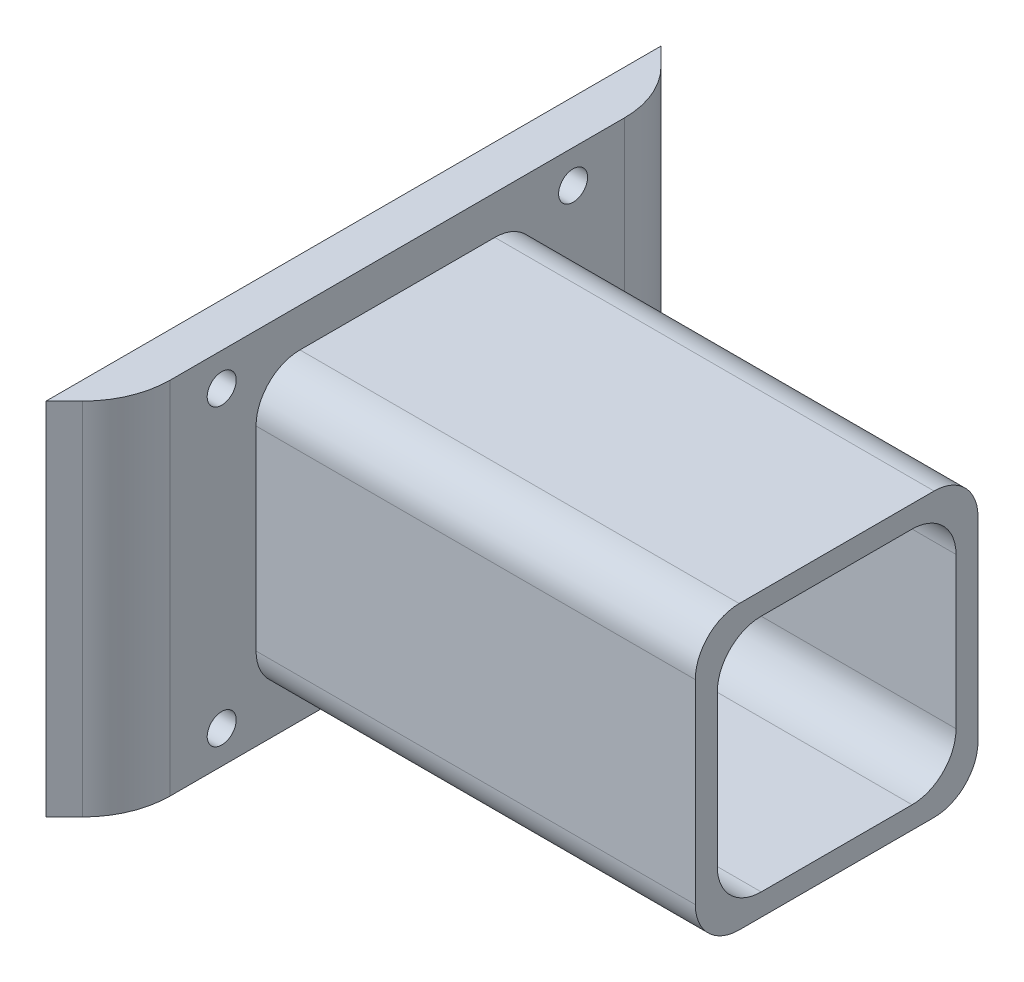
ISO-10303-21;
HEADER;
FILE_DESCRIPTION(('STEP AP214'),'2;1');
FILE_NAME('part.step','',(''),(''),'','','');
FILE_SCHEMA(('AUTOMOTIVE_DESIGN { 1 0 10303 214 1 1 1 1 }'));
ENDSEC;
DATA;
#1=APPLICATION_CONTEXT('core data for automotive mechanical design processes');
#2=APPLICATION_PROTOCOL_DEFINITION('international standard','automotive_design',2000,#1);
#3=PRODUCT_CONTEXT('',#1,'mechanical');
#4=PRODUCT('Part','Part','',(#3));
#5=PRODUCT_RELATED_PRODUCT_CATEGORY('part','',(#4));
#6=PRODUCT_DEFINITION_FORMATION('','',#4);
#7=PRODUCT_DEFINITION_CONTEXT('part definition',#1,'design');
#8=PRODUCT_DEFINITION('design','',#6,#7);
#9=PRODUCT_DEFINITION_SHAPE('','',#8);
#10=(LENGTH_UNIT() NAMED_UNIT(*) SI_UNIT(.MILLI.,.METRE.));
#11=(NAMED_UNIT(*) PLANE_ANGLE_UNIT() SI_UNIT($,.RADIAN.));
#12=(NAMED_UNIT(*) SI_UNIT($,.STERADIAN.) SOLID_ANGLE_UNIT());
#13=UNCERTAINTY_MEASURE_WITH_UNIT(LENGTH_MEASURE(1.E-05),#10,'distance_accuracy_value','');
#14=(GEOMETRIC_REPRESENTATION_CONTEXT(3) GLOBAL_UNCERTAINTY_ASSIGNED_CONTEXT((#13)) GLOBAL_UNIT_ASSIGNED_CONTEXT((#10,
#11,#12)) REPRESENTATION_CONTEXT('',''));
#15=CARTESIAN_POINT('',(0.,0.,0.));
#16=DIRECTION('',(0.,0.,1.));
#17=DIRECTION('',(1.,0.,0.));
#18=AXIS2_PLACEMENT_3D('',#15,#16,#17);
#19=CARTESIAN_POINT('',(10.,0.,0.));
#20=DIRECTION('',(-1.,0.,0.));
#21=DIRECTION('',(0.,0.,1.));
#22=AXIS2_PLACEMENT_3D('',#19,#20,#21);
#23=PLANE('',#22);
#24=DIRECTION('',(0.,0.,-1.));
#25=VECTOR('',#24,1.);
#26=CARTESIAN_POINT('',(10.,-41.,60.));
#27=LINE('',#26,#25);
#28=CARTESIAN_POINT('',(10.,-41.,51.7157287525381));
#29=VERTEX_POINT('',#28);
#30=CARTESIAN_POINT('',(10.,-41.,-51.7157287525381));
#31=VERTEX_POINT('',#30);
#32=EDGE_CURVE('E335',#29,#31,#27,.T.);
#33=ORIENTED_EDGE('',*,*,#32,.T.);
#34=DIRECTION('',(0.,1.,0.));
#35=VECTOR('',#34,1.);
#36=CARTESIAN_POINT('',(10.,41.,-51.7157287525381));
#37=LINE('',#36,#35);
#38=CARTESIAN_POINT('',(10.,41.,-51.7157287525381));
#39=VERTEX_POINT('',#38);
#40=EDGE_CURVE('E344',#31,#39,#37,.T.);
#41=ORIENTED_EDGE('',*,*,#40,.T.);
#42=DIRECTION('',(0.,0.,1.));
#43=VECTOR('',#42,1.);
#44=CARTESIAN_POINT('',(10.,41.,60.));
#45=LINE('',#44,#43);
#46=CARTESIAN_POINT('',(10.,41.,51.7157287525381));
#47=VERTEX_POINT('',#46);
#48=EDGE_CURVE('E332',#39,#47,#45,.T.);
#49=ORIENTED_EDGE('',*,*,#48,.T.);
#50=DIRECTION('',(0.,-1.,0.));
#51=VECTOR('',#50,1.);
#52=CARTESIAN_POINT('',(10.,-41.,51.7157287525381));
#53=LINE('',#52,#51);
#54=EDGE_CURVE('E339',#47,#29,#53,.T.);
#55=ORIENTED_EDGE('',*,*,#54,.T.);
#56=EDGE_LOOP('',(#33,#41,#49,#55));
#57=FACE_BOUND('',#56,.T.);
#58=CARTESIAN_POINT('',(10.,-22.18,-22.18));
#59=DIRECTION('',(1.,0.,0.));
#60=DIRECTION('',(0.,0.,-1.));
#61=AXIS2_PLACEMENT_3D('',#58,#59,#60);
#62=CIRCLE('',#61,10.);
#63=CARTESIAN_POINT('',(10.,-32.18,-22.1799999999999));
#64=VERTEX_POINT('',#63);
#65=CARTESIAN_POINT('',(10.,-22.1799999999999,-32.18));
#66=VERTEX_POINT('',#65);
#67=EDGE_CURVE('E201',#64,#66,#62,.T.);
#68=ORIENTED_EDGE('',*,*,#67,.F.);
#69=DIRECTION('',(0.,0.,-1.));
#70=VECTOR('',#69,1.);
#71=CARTESIAN_POINT('',(10.,-32.18,22.1799999999999));
#72=LINE('',#71,#70);
#73=CARTESIAN_POINT('',(10.,-32.18,22.1799999999999));
#74=VERTEX_POINT('',#73);
#75=EDGE_CURVE('E260',#74,#64,#72,.T.);
#76=ORIENTED_EDGE('',*,*,#75,.F.);
#77=CARTESIAN_POINT('',(10.,-22.18,22.18));
#78=DIRECTION('',(1.,0.,0.));
#79=DIRECTION('',(0.,0.,1.));
#80=AXIS2_PLACEMENT_3D('',#77,#78,#79);
#81=CIRCLE('',#80,10.);
#82=CARTESIAN_POINT('',(9.99999999999999,-22.18,32.18));
#83=VERTEX_POINT('',#82);
#84=EDGE_CURVE('E288',#83,#74,#81,.T.);
#85=ORIENTED_EDGE('',*,*,#84,.F.);
#86=DIRECTION('',(0.,-1.,0.));
#87=VECTOR('',#86,1.);
#88=CARTESIAN_POINT('',(10.,-22.1799999999999,32.18));
#89=LINE('',#88,#87);
#90=CARTESIAN_POINT('',(10.,22.1799999999999,32.18));
#91=VERTEX_POINT('',#90);
#92=EDGE_CURVE('E285',#91,#83,#89,.T.);
#93=ORIENTED_EDGE('',*,*,#92,.F.);
#94=CARTESIAN_POINT('',(10.,22.18,22.18));
#95=DIRECTION('',(1.,0.,0.));
#96=DIRECTION('',(0.,0.,1.));
#97=AXIS2_PLACEMENT_3D('',#94,#95,#96);
#98=CIRCLE('',#97,10.);
#99=CARTESIAN_POINT('',(9.99999999999999,32.18,22.1799999999999));
#100=VERTEX_POINT('',#99);
#101=EDGE_CURVE('E282',#100,#91,#98,.T.);
#102=ORIENTED_EDGE('',*,*,#101,.F.);
#103=DIRECTION('',(0.,0.,1.));
#104=VECTOR('',#103,1.);
#105=CARTESIAN_POINT('',(10.,32.18,22.1799999999999));
#106=LINE('',#105,#104);
#107=CARTESIAN_POINT('',(10.,32.18,-22.1799999999999));
#108=VERTEX_POINT('',#107);
#109=EDGE_CURVE('E279',#108,#100,#106,.T.);
#110=ORIENTED_EDGE('',*,*,#109,.F.);
#111=CARTESIAN_POINT('',(10.,22.18,-22.18));
#112=DIRECTION('',(1.,0.,0.));
#113=DIRECTION('',(0.,0.,1.));
#114=AXIS2_PLACEMENT_3D('',#111,#112,#113);
#115=CIRCLE('',#114,10.);
#116=CARTESIAN_POINT('',(9.99999999999999,22.1799999999999,-32.18));
#117=VERTEX_POINT('',#116);
#118=EDGE_CURVE('E56',#117,#108,#115,.T.);
#119=ORIENTED_EDGE('',*,*,#118,.F.);
#120=DIRECTION('',(0.,1.,0.));
#121=VECTOR('',#120,1.);
#122=CARTESIAN_POINT('',(10.,-22.1799999999999,-32.18));
#123=LINE('',#122,#121);
#124=EDGE_CURVE('E51',#66,#117,#123,.T.);
#125=ORIENTED_EDGE('',*,*,#124,.F.);
#126=EDGE_LOOP('',(#68,#76,#85,#93,#102,#110,#119,#125));
#127=FACE_BOUND('',#126,.T.);
#128=CARTESIAN_POINT('',(10.,-33.5,40.));
#129=DIRECTION('',(1.,0.,0.));
#130=DIRECTION('',(0.,0.,-1.));
#131=AXIS2_PLACEMENT_3D('',#128,#129,#130);
#132=CIRCLE('',#131,3.29999999999999);
#133=CARTESIAN_POINT('',(10.,-33.5,36.7));
#134=VERTEX_POINT('',#133);
#135=EDGE_CURVE('E502',#134,#134,#132,.T.);
#136=ORIENTED_EDGE('',*,*,#135,.F.);
#137=EDGE_LOOP('',(#136));
#138=FACE_BOUND('',#137,.T.);
#139=CARTESIAN_POINT('',(10.,-33.5,-40.));
#140=DIRECTION('',(1.,0.,0.));
#141=DIRECTION('',(0.,0.,-1.));
#142=AXIS2_PLACEMENT_3D('',#139,#140,#141);
#143=CIRCLE('',#142,3.29999999999999);
#144=CARTESIAN_POINT('',(10.,-33.5,-43.3));
#145=VERTEX_POINT('',#144);
#146=EDGE_CURVE('E506',#145,#145,#143,.T.);
#147=ORIENTED_EDGE('',*,*,#146,.F.);
#148=EDGE_LOOP('',(#147));
#149=FACE_BOUND('',#148,.T.);
#150=CARTESIAN_POINT('',(10.,33.5,-40.));
#151=DIRECTION('',(1.,0.,0.));
#152=DIRECTION('',(0.,0.,-1.));
#153=AXIS2_PLACEMENT_3D('',#150,#151,#152);
#154=CIRCLE('',#153,3.29999999999998);
#155=CARTESIAN_POINT('',(10.,33.5,-43.3));
#156=VERTEX_POINT('',#155);
#157=EDGE_CURVE('E510',#156,#156,#154,.T.);
#158=ORIENTED_EDGE('',*,*,#157,.F.);
#159=EDGE_LOOP('',(#158));
#160=FACE_BOUND('',#159,.T.);
#161=CARTESIAN_POINT('',(10.,33.5,40.));
#162=DIRECTION('',(1.,0.,0.));
#163=DIRECTION('',(0.,0.,-1.));
#164=AXIS2_PLACEMENT_3D('',#161,#162,#163);
#165=CIRCLE('',#164,3.29999999999998);
#166=CARTESIAN_POINT('',(10.,33.5,36.7));
#167=VERTEX_POINT('',#166);
#168=EDGE_CURVE('E513',#167,#167,#165,.T.);
#169=ORIENTED_EDGE('',*,*,#168,.F.);
#170=EDGE_LOOP('',(#169));
#171=FACE_BOUND('',#170,.T.);
#172=ADVANCED_FACE('F36',(#57,#127,#138,#149,#160,#171),#23,.F.);
#173=CARTESIAN_POINT('',(10.,41.,60.));
#174=DIRECTION('',(0.,-1.,0.));
#175=DIRECTION('',(0.,0.,-1.));
#176=AXIS2_PLACEMENT_3D('',#173,#174,#175);
#177=PLANE('',#176);
#178=ORIENTED_EDGE('',*,*,#48,.F.);
#179=CARTESIAN_POINT('',(-10.,41.,-51.7157287525381));
#180=DIRECTION('',(0.,-1.,0.));
#181=DIRECTION('',(0.,0.,-1.));
#182=AXIS2_PLACEMENT_3D('',#179,#180,#181);
#183=CIRCLE('',#182,20.);
#184=CARTESIAN_POINT('',(4.14213562373096,41.,-65.857864376269));
#185=VERTEX_POINT('',#184);
#186=EDGE_CURVE('E349',#39,#185,#183,.F.);
#187=ORIENTED_EDGE('',*,*,#186,.T.);
#188=DIRECTION('',(-0.707106781186547,0.,-0.707106781186548));
#189=VECTOR('',#188,1.);
#190=CARTESIAN_POINT('',(0.,41.,-70.));
#191=LINE('',#190,#189);
#192=CARTESIAN_POINT('',(0.,41.,-70.));
#193=VERTEX_POINT('',#192);
#194=EDGE_CURVE('E318',#185,#193,#191,.T.);
#195=ORIENTED_EDGE('',*,*,#194,.T.);
#196=DIRECTION('',(0.,0.,1.));
#197=VECTOR('',#196,1.);
#198=CARTESIAN_POINT('',(0.,41.,60.));
#199=LINE('',#198,#197);
#200=CARTESIAN_POINT('',(0.,41.,70.));
#201=VERTEX_POINT('',#200);
#202=EDGE_CURVE('E331',#193,#201,#199,.T.);
#203=ORIENTED_EDGE('',*,*,#202,.T.);
#204=DIRECTION('',(0.707106781186548,0.,-0.707106781186547));
#205=VECTOR('',#204,1.);
#206=CARTESIAN_POINT('',(0.,41.,70.));
#207=LINE('',#206,#205);
#208=CARTESIAN_POINT('',(4.14213562373093,41.,65.8578643762691));
#209=VERTEX_POINT('',#208);
#210=EDGE_CURVE('E315',#201,#209,#207,.T.);
#211=ORIENTED_EDGE('',*,*,#210,.T.);
#212=CARTESIAN_POINT('',(-10.,41.,51.7157287525381));
#213=DIRECTION('',(0.,-1.,0.));
#214=DIRECTION('',(0.,0.,-1.));
#215=AXIS2_PLACEMENT_3D('',#212,#213,#214);
#216=CIRCLE('',#215,20.);
#217=EDGE_CURVE('E347',#209,#47,#216,.F.);
#218=ORIENTED_EDGE('',*,*,#217,.T.);
#219=EDGE_LOOP('',(#178,#187,#195,#203,#211,#218));
#220=FACE_BOUND('',#219,.T.);
#221=ADVANCED_FACE('F368',(#220),#177,.F.);
#222=CARTESIAN_POINT('',(10.,-41.,60.));
#223=DIRECTION('',(0.,1.,0.));
#224=DIRECTION('',(0.,0.,1.));
#225=AXIS2_PLACEMENT_3D('',#222,#223,#224);
#226=PLANE('',#225);
#227=DIRECTION('',(0.707106781186547,0.,0.707106781186548));
#228=VECTOR('',#227,1.);
#229=CARTESIAN_POINT('',(0.,-41.,-70.));
#230=LINE('',#229,#228);
#231=CARTESIAN_POINT('',(0.,-41.,-70.));
#232=VERTEX_POINT('',#231);
#233=CARTESIAN_POINT('',(4.14213562373096,-41.,-65.857864376269));
#234=VERTEX_POINT('',#233);
#235=EDGE_CURVE('E328',#232,#234,#230,.T.);
#236=ORIENTED_EDGE('',*,*,#235,.T.);
#237=CARTESIAN_POINT('',(-10.,-41.,-51.7157287525381));
#238=DIRECTION('',(0.,1.,0.));
#239=DIRECTION('',(0.,0.,1.));
#240=AXIS2_PLACEMENT_3D('',#237,#238,#239);
#241=CIRCLE('',#240,20.);
#242=EDGE_CURVE('E44',#234,#31,#241,.F.);
#243=ORIENTED_EDGE('',*,*,#242,.T.);
#244=ORIENTED_EDGE('',*,*,#32,.F.);
#245=CARTESIAN_POINT('',(-10.,-41.,51.7157287525381));
#246=DIRECTION('',(0.,1.,0.));
#247=DIRECTION('',(0.,0.,1.));
#248=AXIS2_PLACEMENT_3D('',#245,#246,#247);
#249=CIRCLE('',#248,20.);
#250=CARTESIAN_POINT('',(4.14213562373093,-41.,65.8578643762691));
#251=VERTEX_POINT('',#250);
#252=EDGE_CURVE('E353',#29,#251,#249,.F.);
#253=ORIENTED_EDGE('',*,*,#252,.T.);
#254=DIRECTION('',(-0.707106781186548,0.,0.707106781186547));
#255=VECTOR('',#254,1.);
#256=CARTESIAN_POINT('',(0.,-41.,70.));
#257=LINE('',#256,#255);
#258=CARTESIAN_POINT('',(0.,-41.,70.));
#259=VERTEX_POINT('',#258);
#260=EDGE_CURVE('E316',#251,#259,#257,.T.);
#261=ORIENTED_EDGE('',*,*,#260,.T.);
#262=DIRECTION('',(0.,0.,-1.));
#263=VECTOR('',#262,1.);
#264=CARTESIAN_POINT('',(0.,-41.,60.));
#265=LINE('',#264,#263);
#266=EDGE_CURVE('E336',#259,#232,#265,.T.);
#267=ORIENTED_EDGE('',*,*,#266,.T.);
#268=EDGE_LOOP('',(#236,#243,#244,#253,#261,#267));
#269=FACE_BOUND('',#268,.T.);
#270=ADVANCED_FACE('F357',(#269),#226,.F.);
#271=CARTESIAN_POINT('',(0.,0.,0.));
#272=DIRECTION('',(-1.,0.,0.));
#273=DIRECTION('',(0.,0.,1.));
#274=AXIS2_PLACEMENT_3D('',#271,#272,#273);
#275=PLANE('',#274);
#276=CARTESIAN_POINT('',(0.,33.5,40.));
#277=DIRECTION('',(-1.,0.,0.));
#278=DIRECTION('',(0.,0.,1.));
#279=AXIS2_PLACEMENT_3D('',#276,#277,#278);
#280=CIRCLE('',#279,3.29999999999999);
#281=CARTESIAN_POINT('',(0.,33.5,43.3));
#282=VERTEX_POINT('',#281);
#283=EDGE_CURVE('E515',#282,#282,#280,.T.);
#284=ORIENTED_EDGE('',*,*,#283,.F.);
#285=EDGE_LOOP('',(#284));
#286=FACE_BOUND('',#285,.T.);
#287=CARTESIAN_POINT('',(0.,33.5,-40.));
#288=DIRECTION('',(-1.,0.,0.));
#289=DIRECTION('',(0.,0.,1.));
#290=AXIS2_PLACEMENT_3D('',#287,#288,#289);
#291=CIRCLE('',#290,3.29999999999999);
#292=CARTESIAN_POINT('',(0.,33.5,-36.7));
#293=VERTEX_POINT('',#292);
#294=EDGE_CURVE('E521',#293,#293,#291,.T.);
#295=ORIENTED_EDGE('',*,*,#294,.F.);
#296=EDGE_LOOP('',(#295));
#297=FACE_BOUND('',#296,.T.);
#298=CARTESIAN_POINT('',(0.,-33.5,-40.));
#299=DIRECTION('',(-1.,0.,0.));
#300=DIRECTION('',(0.,0.,1.));
#301=AXIS2_PLACEMENT_3D('',#298,#299,#300);
#302=CIRCLE('',#301,3.29999999999999);
#303=CARTESIAN_POINT('',(0.,-33.5,-36.7));
#304=VERTEX_POINT('',#303);
#305=EDGE_CURVE('E525',#304,#304,#302,.T.);
#306=ORIENTED_EDGE('',*,*,#305,.F.);
#307=EDGE_LOOP('',(#306));
#308=FACE_BOUND('',#307,.T.);
#309=CARTESIAN_POINT('',(0.,-33.5,40.));
#310=DIRECTION('',(-1.,0.,0.));
#311=DIRECTION('',(0.,0.,1.));
#312=AXIS2_PLACEMENT_3D('',#309,#310,#311);
#313=CIRCLE('',#312,3.29999999999999);
#314=CARTESIAN_POINT('',(0.,-33.5,43.3));
#315=VERTEX_POINT('',#314);
#316=EDGE_CURVE('E225',#315,#315,#313,.T.);
#317=ORIENTED_EDGE('',*,*,#316,.F.);
#318=EDGE_LOOP('',(#317));
#319=FACE_BOUND('',#318,.T.);
#320=ORIENTED_EDGE('',*,*,#202,.F.);
#321=DIRECTION('',(0.,1.,0.));
#322=VECTOR('',#321,1.);
#323=CARTESIAN_POINT('',(0.,-55.142135623731,-70.));
#324=LINE('',#323,#322);
#325=EDGE_CURVE('E325',#232,#193,#324,.T.);
#326=ORIENTED_EDGE('',*,*,#325,.F.);
#327=ORIENTED_EDGE('',*,*,#266,.F.);
#328=DIRECTION('',(0.,1.,0.));
#329=VECTOR('',#328,1.);
#330=CARTESIAN_POINT('',(0.,-55.142135623731,70.));
#331=LINE('',#330,#329);
#332=EDGE_CURVE('E319',#259,#201,#331,.T.);
#333=ORIENTED_EDGE('',*,*,#332,.T.);
#334=EDGE_LOOP('',(#320,#326,#327,#333));
#335=FACE_BOUND('',#334,.T.);
#336=ADVANCED_FACE('F375',(#286,#297,#308,#319,#335),#275,.T.);
#337=CARTESIAN_POINT('',(0.,-55.142135623731,-70.));
#338=DIRECTION('',(0.707106781186548,0.,-0.707106781186547));
#339=DIRECTION('',(-0.707106781186547,0.,-0.707106781186548));
#340=AXIS2_PLACEMENT_3D('',#337,#338,#339);
#341=PLANE('',#340);
#342=ORIENTED_EDGE('',*,*,#194,.F.);
#343=DIRECTION('',(0.,1.,0.));
#344=VECTOR('',#343,1.);
#345=CARTESIAN_POINT('',(4.14213562373096,-41.,-65.857864376269));
#346=LINE('',#345,#344);
#347=EDGE_CURVE('E351',#185,#234,#346,.F.);
#348=ORIENTED_EDGE('',*,*,#347,.T.);
#349=ORIENTED_EDGE('',*,*,#235,.F.);
#350=ORIENTED_EDGE('',*,*,#325,.T.);
#351=EDGE_LOOP('',(#342,#348,#349,#350));
#352=FACE_BOUND('',#351,.T.);
#353=ADVANCED_FACE('F371',(#352),#341,.T.);
#354=CARTESIAN_POINT('',(0.,-55.142135623731,70.));
#355=DIRECTION('',(0.707106781186547,0.,0.707106781186548));
#356=DIRECTION('',(0.707106781186548,0.,-0.707106781186547));
#357=AXIS2_PLACEMENT_3D('',#354,#355,#356);
#358=PLANE('',#357);
#359=ORIENTED_EDGE('',*,*,#260,.F.);
#360=DIRECTION('',(0.,-1.,0.));
#361=VECTOR('',#360,1.);
#362=CARTESIAN_POINT('',(4.14213562373094,41.,65.8578643762691));
#363=LINE('',#362,#361);
#364=EDGE_CURVE('E11',#251,#209,#363,.F.);
#365=ORIENTED_EDGE('',*,*,#364,.T.);
#366=ORIENTED_EDGE('',*,*,#210,.F.);
#367=ORIENTED_EDGE('',*,*,#332,.F.);
#368=EDGE_LOOP('',(#359,#365,#366,#367));
#369=FACE_BOUND('',#368,.T.);
#370=ADVANCED_FACE('F383',(#369),#358,.T.);
#371=CARTESIAN_POINT('',(-10.,0.,-51.7157287525381));
#372=DIRECTION('',(0.,-1.,0.));
#373=DIRECTION('',(0.,0.,-1.));
#374=AXIS2_PLACEMENT_3D('',#371,#372,#373);
#375=CYLINDRICAL_SURFACE('',#374,20.);
#376=ORIENTED_EDGE('',*,*,#242,.F.);
#377=ORIENTED_EDGE('',*,*,#347,.F.);
#378=ORIENTED_EDGE('',*,*,#186,.F.);
#379=ORIENTED_EDGE('',*,*,#40,.F.);
#380=EDGE_LOOP('',(#376,#377,#378,#379));
#381=FACE_BOUND('',#380,.T.);
#382=ADVANCED_FACE('F365',(#381),#375,.T.);
#383=CARTESIAN_POINT('',(-10.,0.,51.7157287525381));
#384=DIRECTION('',(0.,1.,0.));
#385=DIRECTION('',(0.,0.,1.));
#386=AXIS2_PLACEMENT_3D('',#383,#384,#385);
#387=CYLINDRICAL_SURFACE('',#386,20.);
#388=ORIENTED_EDGE('',*,*,#217,.F.);
#389=ORIENTED_EDGE('',*,*,#364,.F.);
#390=ORIENTED_EDGE('',*,*,#252,.F.);
#391=ORIENTED_EDGE('',*,*,#54,.F.);
#392=EDGE_LOOP('',(#388,#389,#390,#391));
#393=FACE_BOUND('',#392,.T.);
#394=ADVANCED_FACE('F38',(#393),#387,.T.);
#395=CARTESIAN_POINT('',(110.,-22.18,-22.18));
#396=DIRECTION('',(1.,0.,0.));
#397=DIRECTION('',(0.,0.,-1.));
#398=AXIS2_PLACEMENT_3D('',#395,#396,#397);
#399=PLANE('',#398);
#400=CARTESIAN_POINT('',(110.,-22.18,-22.18));
#401=DIRECTION('',(1.,0.,0.));
#402=DIRECTION('',(0.,0.,-1.));
#403=AXIS2_PLACEMENT_3D('',#400,#401,#402);
#404=CIRCLE('',#403,10.);
#405=CARTESIAN_POINT('',(110.,-32.18,-22.1799999999999));
#406=VERTEX_POINT('',#405);
#407=CARTESIAN_POINT('',(110.,-22.1799999999999,-32.18));
#408=VERTEX_POINT('',#407);
#409=EDGE_CURVE('E256',#406,#408,#404,.T.);
#410=ORIENTED_EDGE('',*,*,#409,.T.);
#411=DIRECTION('',(0.,1.,0.));
#412=VECTOR('',#411,1.);
#413=CARTESIAN_POINT('',(110.,-22.1799999999999,-32.18));
#414=LINE('',#413,#412);
#415=CARTESIAN_POINT('',(110.,22.1799999999999,-32.18));
#416=VERTEX_POINT('',#415);
#417=EDGE_CURVE('E259',#408,#416,#414,.T.);
#418=ORIENTED_EDGE('',*,*,#417,.T.);
#419=CARTESIAN_POINT('',(110.,22.18,-22.18));
#420=DIRECTION('',(1.,0.,0.));
#421=DIRECTION('',(0.,0.,1.));
#422=AXIS2_PLACEMENT_3D('',#419,#420,#421);
#423=CIRCLE('',#422,10.);
#424=CARTESIAN_POINT('',(110.,32.18,-22.1799999999999));
#425=VERTEX_POINT('',#424);
#426=EDGE_CURVE('E262',#416,#425,#423,.T.);
#427=ORIENTED_EDGE('',*,*,#426,.T.);
#428=DIRECTION('',(0.,0.,1.));
#429=VECTOR('',#428,1.);
#430=CARTESIAN_POINT('',(110.,32.18,22.1799999999999));
#431=LINE('',#430,#429);
#432=CARTESIAN_POINT('',(110.,32.18,22.1799999999999));
#433=VERTEX_POINT('',#432);
#434=EDGE_CURVE('E264',#425,#433,#431,.T.);
#435=ORIENTED_EDGE('',*,*,#434,.T.);
#436=CARTESIAN_POINT('',(110.,22.18,22.18));
#437=DIRECTION('',(1.,0.,0.));
#438=DIRECTION('',(0.,0.,1.));
#439=AXIS2_PLACEMENT_3D('',#436,#437,#438);
#440=CIRCLE('',#439,10.);
#441=CARTESIAN_POINT('',(110.,22.1799999999999,32.18));
#442=VERTEX_POINT('',#441);
#443=EDGE_CURVE('E266',#433,#442,#440,.T.);
#444=ORIENTED_EDGE('',*,*,#443,.T.);
#445=DIRECTION('',(0.,-1.,0.));
#446=VECTOR('',#445,1.);
#447=CARTESIAN_POINT('',(110.,-22.1799999999999,32.18));
#448=LINE('',#447,#446);
#449=CARTESIAN_POINT('',(110.,-22.18,32.18));
#450=VERTEX_POINT('',#449);
#451=EDGE_CURVE('E268',#442,#450,#448,.T.);
#452=ORIENTED_EDGE('',*,*,#451,.T.);
#453=CARTESIAN_POINT('',(110.,-22.18,22.18));
#454=DIRECTION('',(1.,0.,0.));
#455=DIRECTION('',(0.,0.,1.));
#456=AXIS2_PLACEMENT_3D('',#453,#454,#455);
#457=CIRCLE('',#456,10.);
#458=CARTESIAN_POINT('',(110.,-32.18,22.1799999999999));
#459=VERTEX_POINT('',#458);
#460=EDGE_CURVE('E270',#450,#459,#457,.T.);
#461=ORIENTED_EDGE('',*,*,#460,.T.);
#462=DIRECTION('',(0.,0.,-1.));
#463=VECTOR('',#462,1.);
#464=CARTESIAN_POINT('',(110.,-32.18,22.1799999999999));
#465=LINE('',#464,#463);
#466=EDGE_CURVE('E272',#459,#406,#465,.T.);
#467=ORIENTED_EDGE('',*,*,#466,.T.);
#468=EDGE_LOOP('',(#410,#418,#427,#435,#444,#452,#461,#467));
#469=FACE_BOUND('',#468,.T.);
#470=DIRECTION('',(0.,0.,-1.));
#471=VECTOR('',#470,1.);
#472=CARTESIAN_POINT('',(110.,-27.18,17.1799999999999));
#473=LINE('',#472,#471);
#474=CARTESIAN_POINT('',(110.,-27.18,17.1799999999999));
#475=VERTEX_POINT('',#474);
#476=CARTESIAN_POINT('',(110.,-27.18,-17.1799999999999));
#477=VERTEX_POINT('',#476);
#478=EDGE_CURVE('E193',#475,#477,#473,.T.);
#479=ORIENTED_EDGE('',*,*,#478,.F.);
#480=CARTESIAN_POINT('',(110.,-17.18,17.18));
#481=DIRECTION('',(1.,0.,0.));
#482=DIRECTION('',(0.,0.,1.));
#483=AXIS2_PLACEMENT_3D('',#480,#481,#482);
#484=CIRCLE('',#483,10.);
#485=CARTESIAN_POINT('',(110.,-17.1799999999999,27.18));
#486=VERTEX_POINT('',#485);
#487=EDGE_CURVE('E183',#486,#475,#484,.T.);
#488=ORIENTED_EDGE('',*,*,#487,.F.);
#489=DIRECTION('',(0.,-1.,0.));
#490=VECTOR('',#489,1.);
#491=CARTESIAN_POINT('',(110.,-17.1799999999999,27.18));
#492=LINE('',#491,#490);
#493=CARTESIAN_POINT('',(110.,17.1799999999999,27.18));
#494=VERTEX_POINT('',#493);
#495=EDGE_CURVE('E221',#494,#486,#492,.T.);
#496=ORIENTED_EDGE('',*,*,#495,.F.);
#497=CARTESIAN_POINT('',(110.,17.18,17.18));
#498=DIRECTION('',(1.,0.,0.));
#499=DIRECTION('',(0.,0.,1.));
#500=AXIS2_PLACEMENT_3D('',#497,#498,#499);
#501=CIRCLE('',#500,10.);
#502=CARTESIAN_POINT('',(110.,27.18,17.1799999999999));
#503=VERTEX_POINT('',#502);
#504=EDGE_CURVE('E218',#503,#494,#501,.T.);
#505=ORIENTED_EDGE('',*,*,#504,.F.);
#506=DIRECTION('',(0.,0.,1.));
#507=VECTOR('',#506,1.);
#508=CARTESIAN_POINT('',(110.,27.18,17.1799999999999));
#509=LINE('',#508,#507);
#510=CARTESIAN_POINT('',(110.,27.18,-17.1799999999999));
#511=VERTEX_POINT('',#510);
#512=EDGE_CURVE('E216',#511,#503,#509,.T.);
#513=ORIENTED_EDGE('',*,*,#512,.F.);
#514=CARTESIAN_POINT('',(110.,17.18,-17.18));
#515=DIRECTION('',(1.,0.,0.));
#516=DIRECTION('',(0.,0.,1.));
#517=AXIS2_PLACEMENT_3D('',#514,#515,#516);
#518=CIRCLE('',#517,10.);
#519=CARTESIAN_POINT('',(110.,17.1799999999999,-27.18));
#520=VERTEX_POINT('',#519);
#521=EDGE_CURVE('E214',#520,#511,#518,.T.);
#522=ORIENTED_EDGE('',*,*,#521,.F.);
#523=DIRECTION('',(0.,1.,0.));
#524=VECTOR('',#523,1.);
#525=CARTESIAN_POINT('',(110.,-17.1799999999999,-27.18));
#526=LINE('',#525,#524);
#527=CARTESIAN_POINT('',(110.,-17.18,-27.18));
#528=VERTEX_POINT('',#527);
#529=EDGE_CURVE('E209',#528,#520,#526,.T.);
#530=ORIENTED_EDGE('',*,*,#529,.F.);
#531=CARTESIAN_POINT('',(110.,-17.18,-17.18));
#532=DIRECTION('',(1.,0.,0.));
#533=DIRECTION('',(0.,0.,-1.));
#534=AXIS2_PLACEMENT_3D('',#531,#532,#533);
#535=CIRCLE('',#534,10.);
#536=EDGE_CURVE('E207',#477,#528,#535,.T.);
#537=ORIENTED_EDGE('',*,*,#536,.F.);
#538=EDGE_LOOP('',(#479,#488,#496,#505,#513,#522,#530,#537));
#539=FACE_BOUND('',#538,.T.);
#540=ADVANCED_FACE('F205',(#469,#539),#399,.T.);
#541=CARTESIAN_POINT('',(110.,-22.18,-22.18));
#542=DIRECTION('',(-1.,0.,0.));
#543=DIRECTION('',(0.,0.,1.));
#544=AXIS2_PLACEMENT_3D('',#541,#542,#543);
#545=CYLINDRICAL_SURFACE('',#544,10.);
#546=ORIENTED_EDGE('',*,*,#67,.T.);
#547=DIRECTION('',(-1.,0.,0.));
#548=VECTOR('',#547,1.);
#549=CARTESIAN_POINT('',(110.,-22.1799999999999,-32.18));
#550=LINE('',#549,#548);
#551=EDGE_CURVE('E313',#408,#66,#550,.T.);
#552=ORIENTED_EDGE('',*,*,#551,.F.);
#553=ORIENTED_EDGE('',*,*,#409,.F.);
#554=DIRECTION('',(-1.,0.,0.));
#555=VECTOR('',#554,1.);
#556=CARTESIAN_POINT('',(110.,-32.18,-22.1799999999999));
#557=LINE('',#556,#555);
#558=EDGE_CURVE('E274',#406,#64,#557,.T.);
#559=ORIENTED_EDGE('',*,*,#558,.T.);
#560=EDGE_LOOP('',(#546,#552,#553,#559));
#561=FACE_BOUND('',#560,.T.);
#562=ADVANCED_FACE('F451',(#561),#545,.T.);
#563=CARTESIAN_POINT('',(110.,-22.1799999999999,-32.18));
#564=DIRECTION('',(0.,0.,1.));
#565=DIRECTION('',(1.,0.,0.));
#566=AXIS2_PLACEMENT_3D('',#563,#564,#565);
#567=PLANE('',#566);
#568=ORIENTED_EDGE('',*,*,#124,.T.);
#569=DIRECTION('',(-1.,0.,0.));
#570=VECTOR('',#569,1.);
#571=CARTESIAN_POINT('',(110.,22.1799999999999,-32.18));
#572=LINE('',#571,#570);
#573=EDGE_CURVE('E310',#416,#117,#572,.T.);
#574=ORIENTED_EDGE('',*,*,#573,.F.);
#575=ORIENTED_EDGE('',*,*,#417,.F.);
#576=ORIENTED_EDGE('',*,*,#551,.T.);
#577=EDGE_LOOP('',(#568,#574,#575,#576));
#578=FACE_BOUND('',#577,.T.);
#579=ADVANCED_FACE('F475',(#578),#567,.F.);
#580=CARTESIAN_POINT('',(110.,22.18,-22.18));
#581=DIRECTION('',(-1.,0.,0.));
#582=DIRECTION('',(0.,0.,1.));
#583=AXIS2_PLACEMENT_3D('',#580,#581,#582);
#584=CYLINDRICAL_SURFACE('',#583,10.);
#585=ORIENTED_EDGE('',*,*,#118,.T.);
#586=DIRECTION('',(-1.,0.,0.));
#587=VECTOR('',#586,1.);
#588=CARTESIAN_POINT('',(110.,32.18,-22.1799999999999));
#589=LINE('',#588,#587);
#590=EDGE_CURVE('E307',#425,#108,#589,.T.);
#591=ORIENTED_EDGE('',*,*,#590,.F.);
#592=ORIENTED_EDGE('',*,*,#426,.F.);
#593=ORIENTED_EDGE('',*,*,#573,.T.);
#594=EDGE_LOOP('',(#585,#591,#592,#593));
#595=FACE_BOUND('',#594,.T.);
#596=ADVANCED_FACE('F471',(#595),#584,.T.);
#597=CARTESIAN_POINT('',(110.,32.18,22.1799999999999));
#598=DIRECTION('',(0.,-1.,0.));
#599=DIRECTION('',(0.,0.,-1.));
#600=AXIS2_PLACEMENT_3D('',#597,#598,#599);
#601=PLANE('',#600);
#602=ORIENTED_EDGE('',*,*,#109,.T.);
#603=DIRECTION('',(-1.,0.,0.));
#604=VECTOR('',#603,1.);
#605=CARTESIAN_POINT('',(110.,32.18,22.1799999999999));
#606=LINE('',#605,#604);
#607=EDGE_CURVE('E304',#433,#100,#606,.T.);
#608=ORIENTED_EDGE('',*,*,#607,.F.);
#609=ORIENTED_EDGE('',*,*,#434,.F.);
#610=ORIENTED_EDGE('',*,*,#590,.T.);
#611=EDGE_LOOP('',(#602,#608,#609,#610));
#612=FACE_BOUND('',#611,.T.);
#613=ADVANCED_FACE('F467',(#612),#601,.F.);
#614=CARTESIAN_POINT('',(110.,22.18,22.18));
#615=DIRECTION('',(-1.,0.,0.));
#616=DIRECTION('',(0.,0.,1.));
#617=AXIS2_PLACEMENT_3D('',#614,#615,#616);
#618=CYLINDRICAL_SURFACE('',#617,10.);
#619=ORIENTED_EDGE('',*,*,#101,.T.);
#620=DIRECTION('',(-1.,0.,0.));
#621=VECTOR('',#620,1.);
#622=CARTESIAN_POINT('',(110.,22.1799999999999,32.18));
#623=LINE('',#622,#621);
#624=EDGE_CURVE('E301',#442,#91,#623,.T.);
#625=ORIENTED_EDGE('',*,*,#624,.F.);
#626=ORIENTED_EDGE('',*,*,#443,.F.);
#627=ORIENTED_EDGE('',*,*,#607,.T.);
#628=EDGE_LOOP('',(#619,#625,#626,#627));
#629=FACE_BOUND('',#628,.T.);
#630=ADVANCED_FACE('F463',(#629),#618,.T.);
#631=CARTESIAN_POINT('',(110.,-22.1799999999999,32.18));
#632=DIRECTION('',(0.,0.,-1.));
#633=DIRECTION('',(-1.,0.,0.));
#634=AXIS2_PLACEMENT_3D('',#631,#632,#633);
#635=PLANE('',#634);
#636=ORIENTED_EDGE('',*,*,#92,.T.);
#637=DIRECTION('',(-1.,0.,0.));
#638=VECTOR('',#637,1.);
#639=CARTESIAN_POINT('',(110.,-22.18,32.18));
#640=LINE('',#639,#638);
#641=EDGE_CURVE('E298',#450,#83,#640,.T.);
#642=ORIENTED_EDGE('',*,*,#641,.F.);
#643=ORIENTED_EDGE('',*,*,#451,.F.);
#644=ORIENTED_EDGE('',*,*,#624,.T.);
#645=EDGE_LOOP('',(#636,#642,#643,#644));
#646=FACE_BOUND('',#645,.T.);
#647=ADVANCED_FACE('F459',(#646),#635,.F.);
#648=CARTESIAN_POINT('',(110.,-22.18,22.18));
#649=DIRECTION('',(-1.,0.,0.));
#650=DIRECTION('',(0.,0.,1.));
#651=AXIS2_PLACEMENT_3D('',#648,#649,#650);
#652=CYLINDRICAL_SURFACE('',#651,10.);
#653=ORIENTED_EDGE('',*,*,#84,.T.);
#654=DIRECTION('',(-1.,0.,0.));
#655=VECTOR('',#654,1.);
#656=CARTESIAN_POINT('',(110.,-32.18,22.1799999999999));
#657=LINE('',#656,#655);
#658=EDGE_CURVE('E295',#459,#74,#657,.T.);
#659=ORIENTED_EDGE('',*,*,#658,.F.);
#660=ORIENTED_EDGE('',*,*,#460,.F.);
#661=ORIENTED_EDGE('',*,*,#641,.T.);
#662=EDGE_LOOP('',(#653,#659,#660,#661));
#663=FACE_BOUND('',#662,.T.);
#664=ADVANCED_FACE('F455',(#663),#652,.T.);
#665=CARTESIAN_POINT('',(110.,-32.18,22.1799999999999));
#666=DIRECTION('',(0.,1.,0.));
#667=DIRECTION('',(0.,0.,1.));
#668=AXIS2_PLACEMENT_3D('',#665,#666,#667);
#669=PLANE('',#668);
#670=ORIENTED_EDGE('',*,*,#75,.T.);
#671=ORIENTED_EDGE('',*,*,#558,.F.);
#672=ORIENTED_EDGE('',*,*,#466,.F.);
#673=ORIENTED_EDGE('',*,*,#658,.T.);
#674=EDGE_LOOP('',(#670,#671,#672,#673));
#675=FACE_BOUND('',#674,.T.);
#676=ADVANCED_FACE('F448',(#675),#669,.F.);
#677=CARTESIAN_POINT('',(110.,-17.18,17.18));
#678=DIRECTION('',(-1.,0.,0.));
#679=DIRECTION('',(0.,0.,1.));
#680=AXIS2_PLACEMENT_3D('',#677,#678,#679);
#681=CYLINDRICAL_SURFACE('',#680,10.);
#682=CARTESIAN_POINT('',(10.,-17.18,17.18));
#683=DIRECTION('',(1.,0.,0.));
#684=DIRECTION('',(0.,0.,1.));
#685=AXIS2_PLACEMENT_3D('',#682,#683,#684);
#686=CIRCLE('',#685,10.);
#687=CARTESIAN_POINT('',(10.,-17.1799999999999,27.18));
#688=VERTEX_POINT('',#687);
#689=CARTESIAN_POINT('',(10.,-27.18,17.1799999999999));
#690=VERTEX_POINT('',#689);
#691=EDGE_CURVE('E223',#688,#690,#686,.T.);
#692=ORIENTED_EDGE('',*,*,#691,.F.);
#693=DIRECTION('',(-1.,0.,0.));
#694=VECTOR('',#693,1.);
#695=CARTESIAN_POINT('',(110.,-17.1799999999999,27.18));
#696=LINE('',#695,#694);
#697=EDGE_CURVE('E189',#486,#688,#696,.T.);
#698=ORIENTED_EDGE('',*,*,#697,.F.);
#699=ORIENTED_EDGE('',*,*,#487,.T.);
#700=DIRECTION('',(-1.,0.,0.));
#701=VECTOR('',#700,1.);
#702=CARTESIAN_POINT('',(110.,-27.18,17.1799999999999));
#703=LINE('',#702,#701);
#704=EDGE_CURVE('E187',#475,#690,#703,.T.);
#705=ORIENTED_EDGE('',*,*,#704,.T.);
#706=EDGE_LOOP('',(#692,#698,#699,#705));
#707=FACE_BOUND('',#706,.T.);
#708=ADVANCED_FACE('F186',(#707),#681,.F.);
#709=CARTESIAN_POINT('',(110.,-27.18,17.1799999999999));
#710=DIRECTION('',(0.,1.,0.));
#711=DIRECTION('',(0.,0.,1.));
#712=AXIS2_PLACEMENT_3D('',#709,#710,#711);
#713=PLANE('',#712);
#714=DIRECTION('',(0.,0.,-1.));
#715=VECTOR('',#714,1.);
#716=CARTESIAN_POINT('',(10.,-27.18,17.1799999999999));
#717=LINE('',#716,#715);
#718=CARTESIAN_POINT('',(10.,-27.18,-17.1799999999999));
#719=VERTEX_POINT('',#718);
#720=EDGE_CURVE('E200',#690,#719,#717,.T.);
#721=ORIENTED_EDGE('',*,*,#720,.F.);
#722=ORIENTED_EDGE('',*,*,#704,.F.);
#723=ORIENTED_EDGE('',*,*,#478,.T.);
#724=DIRECTION('',(-1.,0.,0.));
#725=VECTOR('',#724,1.);
#726=CARTESIAN_POINT('',(110.,-27.18,-17.1799999999999));
#727=LINE('',#726,#725);
#728=EDGE_CURVE('E202',#477,#719,#727,.T.);
#729=ORIENTED_EDGE('',*,*,#728,.T.);
#730=EDGE_LOOP('',(#721,#722,#723,#729));
#731=FACE_BOUND('',#730,.T.);
#732=ADVANCED_FACE('F197',(#731),#713,.T.);
#733=CARTESIAN_POINT('',(110.,-17.18,-17.18));
#734=DIRECTION('',(-1.,0.,0.));
#735=DIRECTION('',(0.,0.,1.));
#736=AXIS2_PLACEMENT_3D('',#733,#734,#735);
#737=CYLINDRICAL_SURFACE('',#736,10.);
#738=CARTESIAN_POINT('',(10.,-17.18,-17.18));
#739=DIRECTION('',(1.,0.,0.));
#740=DIRECTION('',(0.,0.,-1.));
#741=AXIS2_PLACEMENT_3D('',#738,#739,#740);
#742=CIRCLE('',#741,10.);
#743=CARTESIAN_POINT('',(10.,-17.18,-27.18));
#744=VERTEX_POINT('',#743);
#745=EDGE_CURVE('E227',#719,#744,#742,.T.);
#746=ORIENTED_EDGE('',*,*,#745,.F.);
#747=ORIENTED_EDGE('',*,*,#728,.F.);
#748=ORIENTED_EDGE('',*,*,#536,.T.);
#749=DIRECTION('',(-1.,0.,0.));
#750=VECTOR('',#749,1.);
#751=CARTESIAN_POINT('',(110.,-17.18,-27.18));
#752=LINE('',#751,#750);
#753=EDGE_CURVE('E253',#528,#744,#752,.T.);
#754=ORIENTED_EDGE('',*,*,#753,.T.);
#755=EDGE_LOOP('',(#746,#747,#748,#754));
#756=FACE_BOUND('',#755,.T.);
#757=ADVANCED_FACE('F435',(#756),#737,.F.);
#758=CARTESIAN_POINT('',(110.,-17.1799999999999,-27.18));
#759=DIRECTION('',(0.,0.,1.));
#760=DIRECTION('',(1.,0.,0.));
#761=AXIS2_PLACEMENT_3D('',#758,#759,#760);
#762=PLANE('',#761);
#763=DIRECTION('',(0.,1.,0.));
#764=VECTOR('',#763,1.);
#765=CARTESIAN_POINT('',(10.,-17.1799999999999,-27.18));
#766=LINE('',#765,#764);
#767=CARTESIAN_POINT('',(10.,17.1799999999999,-27.18));
#768=VERTEX_POINT('',#767);
#769=EDGE_CURVE('E230',#744,#768,#766,.T.);
#770=ORIENTED_EDGE('',*,*,#769,.F.);
#771=ORIENTED_EDGE('',*,*,#753,.F.);
#772=ORIENTED_EDGE('',*,*,#529,.T.);
#773=DIRECTION('',(-1.,0.,0.));
#774=VECTOR('',#773,1.);
#775=CARTESIAN_POINT('',(110.,17.1799999999999,-27.18));
#776=LINE('',#775,#774);
#777=EDGE_CURVE('E251',#520,#768,#776,.T.);
#778=ORIENTED_EDGE('',*,*,#777,.T.);
#779=EDGE_LOOP('',(#770,#771,#772,#778));
#780=FACE_BOUND('',#779,.T.);
#781=ADVANCED_FACE('F432',(#780),#762,.T.);
#782=CARTESIAN_POINT('',(110.,17.18,-17.18));
#783=DIRECTION('',(-1.,0.,0.));
#784=DIRECTION('',(0.,0.,1.));
#785=AXIS2_PLACEMENT_3D('',#782,#783,#784);
#786=CYLINDRICAL_SURFACE('',#785,10.);
#787=CARTESIAN_POINT('',(10.,17.18,-17.18));
#788=DIRECTION('',(1.,0.,0.));
#789=DIRECTION('',(0.,0.,1.));
#790=AXIS2_PLACEMENT_3D('',#787,#788,#789);
#791=CIRCLE('',#790,10.);
#792=CARTESIAN_POINT('',(10.,27.18,-17.1799999999999));
#793=VERTEX_POINT('',#792);
#794=EDGE_CURVE('E233',#768,#793,#791,.T.);
#795=ORIENTED_EDGE('',*,*,#794,.F.);
#796=ORIENTED_EDGE('',*,*,#777,.F.);
#797=ORIENTED_EDGE('',*,*,#521,.T.);
#798=DIRECTION('',(-1.,0.,0.));
#799=VECTOR('',#798,1.);
#800=CARTESIAN_POINT('',(110.,27.18,-17.1799999999999));
#801=LINE('',#800,#799);
#802=EDGE_CURVE('E249',#511,#793,#801,.T.);
#803=ORIENTED_EDGE('',*,*,#802,.T.);
#804=EDGE_LOOP('',(#795,#796,#797,#803));
#805=FACE_BOUND('',#804,.T.);
#806=ADVANCED_FACE('F427',(#805),#786,.F.);
#807=CARTESIAN_POINT('',(110.,27.18,17.1799999999999));
#808=DIRECTION('',(0.,-1.,0.));
#809=DIRECTION('',(0.,0.,-1.));
#810=AXIS2_PLACEMENT_3D('',#807,#808,#809);
#811=PLANE('',#810);
#812=DIRECTION('',(0.,0.,1.));
#813=VECTOR('',#812,1.);
#814=CARTESIAN_POINT('',(10.,27.18,17.1799999999999));
#815=LINE('',#814,#813);
#816=CARTESIAN_POINT('',(10.,27.18,17.1799999999999));
#817=VERTEX_POINT('',#816);
#818=EDGE_CURVE('E236',#793,#817,#815,.T.);
#819=ORIENTED_EDGE('',*,*,#818,.F.);
#820=ORIENTED_EDGE('',*,*,#802,.F.);
#821=ORIENTED_EDGE('',*,*,#512,.T.);
#822=DIRECTION('',(-1.,0.,0.));
#823=VECTOR('',#822,1.);
#824=CARTESIAN_POINT('',(110.,27.18,17.1799999999999));
#825=LINE('',#824,#823);
#826=EDGE_CURVE('E247',#503,#817,#825,.T.);
#827=ORIENTED_EDGE('',*,*,#826,.T.);
#828=EDGE_LOOP('',(#819,#820,#821,#827));
#829=FACE_BOUND('',#828,.T.);
#830=ADVANCED_FACE('F423',(#829),#811,.T.);
#831=CARTESIAN_POINT('',(110.,17.18,17.18));
#832=DIRECTION('',(-1.,0.,0.));
#833=DIRECTION('',(0.,0.,1.));
#834=AXIS2_PLACEMENT_3D('',#831,#832,#833);
#835=CYLINDRICAL_SURFACE('',#834,10.);
#836=CARTESIAN_POINT('',(10.,17.18,17.18));
#837=DIRECTION('',(1.,0.,0.));
#838=DIRECTION('',(0.,0.,1.));
#839=AXIS2_PLACEMENT_3D('',#836,#837,#838);
#840=CIRCLE('',#839,10.);
#841=CARTESIAN_POINT('',(10.,17.1799999999999,27.18));
#842=VERTEX_POINT('',#841);
#843=EDGE_CURVE('E239',#817,#842,#840,.T.);
#844=ORIENTED_EDGE('',*,*,#843,.F.);
#845=ORIENTED_EDGE('',*,*,#826,.F.);
#846=ORIENTED_EDGE('',*,*,#504,.T.);
#847=DIRECTION('',(-1.,0.,0.));
#848=VECTOR('',#847,1.);
#849=CARTESIAN_POINT('',(110.,17.1799999999999,27.18));
#850=LINE('',#849,#848);
#851=EDGE_CURVE('E245',#494,#842,#850,.T.);
#852=ORIENTED_EDGE('',*,*,#851,.T.);
#853=EDGE_LOOP('',(#844,#845,#846,#852));
#854=FACE_BOUND('',#853,.T.);
#855=ADVANCED_FACE('F411',(#854),#835,.F.);
#856=CARTESIAN_POINT('',(110.,-17.1799999999999,27.18));
#857=DIRECTION('',(0.,0.,-1.));
#858=DIRECTION('',(-1.,0.,0.));
#859=AXIS2_PLACEMENT_3D('',#856,#857,#858);
#860=PLANE('',#859);
#861=DIRECTION('',(0.,-1.,0.));
#862=VECTOR('',#861,1.);
#863=CARTESIAN_POINT('',(10.,-17.1799999999999,27.18));
#864=LINE('',#863,#862);
#865=EDGE_CURVE('E194',#842,#688,#864,.T.);
#866=ORIENTED_EDGE('',*,*,#865,.F.);
#867=ORIENTED_EDGE('',*,*,#851,.F.);
#868=ORIENTED_EDGE('',*,*,#495,.T.);
#869=ORIENTED_EDGE('',*,*,#697,.T.);
#870=EDGE_LOOP('',(#866,#867,#868,#869));
#871=FACE_BOUND('',#870,.T.);
#872=ADVANCED_FACE('F402',(#871),#860,.T.);
#873=ORIENTED_EDGE('',*,*,#865,.T.);
#874=ORIENTED_EDGE('',*,*,#691,.T.);
#875=ORIENTED_EDGE('',*,*,#720,.T.);
#876=ORIENTED_EDGE('',*,*,#745,.T.);
#877=ORIENTED_EDGE('',*,*,#769,.T.);
#878=ORIENTED_EDGE('',*,*,#794,.T.);
#879=ORIENTED_EDGE('',*,*,#818,.T.);
#880=ORIENTED_EDGE('',*,*,#843,.T.);
#881=EDGE_LOOP('',(#873,#874,#875,#876,#877,#878,#879,#880));
#882=FACE_BOUND('',#881,.T.);
#883=ADVANCED_FACE('F394',(#882),#23,.F.);
#884=CARTESIAN_POINT('',(10.,-33.5,40.));
#885=DIRECTION('',(1.,0.,0.));
#886=DIRECTION('',(0.,0.,-1.));
#887=AXIS2_PLACEMENT_3D('',#884,#885,#886);
#888=CYLINDRICAL_SURFACE('',#887,3.29999999999999);
#889=ORIENTED_EDGE('',*,*,#135,.T.);
#890=EDGE_LOOP('',(#889));
#891=FACE_BOUND('',#890,.T.);
#892=ORIENTED_EDGE('',*,*,#316,.T.);
#893=EDGE_LOOP('',(#892));
#894=FACE_BOUND('',#893,.T.);
#895=ADVANCED_FACE('F401',(#891,#894),#888,.F.);
#896=CARTESIAN_POINT('',(10.,-33.5,-40.));
#897=DIRECTION('',(1.,0.,0.));
#898=DIRECTION('',(0.,0.,-1.));
#899=AXIS2_PLACEMENT_3D('',#896,#897,#898);
#900=CYLINDRICAL_SURFACE('',#899,3.29999999999999);
#901=ORIENTED_EDGE('',*,*,#146,.T.);
#902=EDGE_LOOP('',(#901));
#903=FACE_BOUND('',#902,.T.);
#904=ORIENTED_EDGE('',*,*,#305,.T.);
#905=EDGE_LOOP('',(#904));
#906=FACE_BOUND('',#905,.T.);
#907=ADVANCED_FACE('F408',(#903,#906),#900,.F.);
#908=CARTESIAN_POINT('',(10.,33.5,-40.));
#909=DIRECTION('',(1.,0.,0.));
#910=DIRECTION('',(0.,0.,-1.));
#911=AXIS2_PLACEMENT_3D('',#908,#909,#910);
#912=CYLINDRICAL_SURFACE('',#911,3.29999999999999);
#913=ORIENTED_EDGE('',*,*,#157,.T.);
#914=EDGE_LOOP('',(#913));
#915=FACE_BOUND('',#914,.T.);
#916=ORIENTED_EDGE('',*,*,#294,.T.);
#917=EDGE_LOOP('',(#916));
#918=FACE_BOUND('',#917,.T.);
#919=ADVANCED_FACE('F545',(#915,#918),#912,.F.);
#920=CARTESIAN_POINT('',(10.,33.5,40.));
#921=DIRECTION('',(1.,0.,0.));
#922=DIRECTION('',(0.,0.,-1.));
#923=AXIS2_PLACEMENT_3D('',#920,#921,#922);
#924=CYLINDRICAL_SURFACE('',#923,3.29999999999999);
#925=ORIENTED_EDGE('',*,*,#168,.T.);
#926=EDGE_LOOP('',(#925));
#927=FACE_BOUND('',#926,.T.);
#928=ORIENTED_EDGE('',*,*,#283,.T.);
#929=EDGE_LOOP('',(#928));
#930=FACE_BOUND('',#929,.T.);
#931=ADVANCED_FACE('F551',(#927,#930),#924,.F.);
#932=CLOSED_SHELL('',(#172,#221,#270,#336,#353,#370,#382,#394,#540,#562,#579,#596,#613,#630,
#647,#664,#676,#708,#732,#757,#781,#806,#830,#855,#872,#883,#895,#907,#919,#931));
#933=MANIFOLD_SOLID_BREP('B2',#932);
#934=ADVANCED_BREP_SHAPE_REPRESENTATION('',(#18,#933),#14);
#935=SHAPE_DEFINITION_REPRESENTATION(#9,#934);
ENDSEC;
END-ISO-10303-21;
